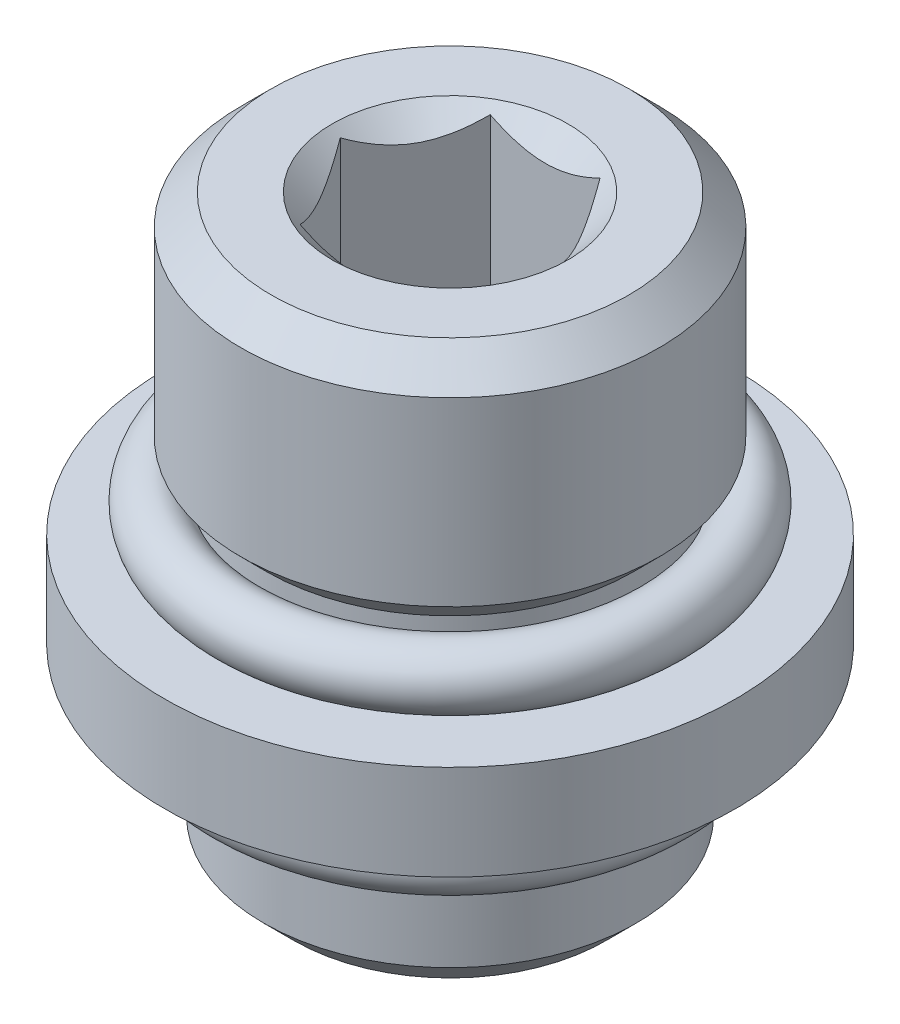
ISO-10303-21;
HEADER;
FILE_DESCRIPTION(('STEP AP214'),'2;1');
FILE_NAME('part.step','',(''),(''),'','','');
FILE_SCHEMA(('AUTOMOTIVE_DESIGN { 1 0 10303 214 1 1 1 1 }'));
ENDSEC;
DATA;
#1=APPLICATION_CONTEXT('core data for automotive mechanical design processes');
#2=APPLICATION_PROTOCOL_DEFINITION('international standard','automotive_design',2000,#1);
#3=PRODUCT_CONTEXT('',#1,'mechanical');
#4=PRODUCT('Part','Part','',(#3));
#5=PRODUCT_RELATED_PRODUCT_CATEGORY('part','',(#4));
#6=PRODUCT_DEFINITION_FORMATION('','',#4);
#7=PRODUCT_DEFINITION_CONTEXT('part definition',#1,'design');
#8=PRODUCT_DEFINITION('design','',#6,#7);
#9=PRODUCT_DEFINITION_SHAPE('','',#8);
#10=(LENGTH_UNIT() NAMED_UNIT(*) SI_UNIT(.MILLI.,.METRE.));
#11=(NAMED_UNIT(*) PLANE_ANGLE_UNIT() SI_UNIT($,.RADIAN.));
#12=(NAMED_UNIT(*) SI_UNIT($,.STERADIAN.) SOLID_ANGLE_UNIT());
#13=UNCERTAINTY_MEASURE_WITH_UNIT(LENGTH_MEASURE(1.E-05),#10,'distance_accuracy_value','');
#14=(GEOMETRIC_REPRESENTATION_CONTEXT(3) GLOBAL_UNCERTAINTY_ASSIGNED_CONTEXT((#13)) GLOBAL_UNIT_ASSIGNED_CONTEXT((#10,
#11,#12)) REPRESENTATION_CONTEXT('',''));
#15=CARTESIAN_POINT('',(0.,0.,0.));
#16=DIRECTION('',(0.,0.,1.));
#17=DIRECTION('',(1.,0.,0.));
#18=AXIS2_PLACEMENT_3D('',#15,#16,#17);
#19=CARTESIAN_POINT('',(0.,-2.87655,0.));
#20=DIRECTION('',(0.,-1.,0.));
#21=DIRECTION('',(0.,0.,-1.));
#22=AXIS2_PLACEMENT_3D('',#19,#20,#21);
#23=CYLINDRICAL_SURFACE('',#22,6.223);
#24=CARTESIAN_POINT('',(0.,-4.36308409543976,0.));
#25=DIRECTION('',(0.,-1.,0.));
#26=DIRECTION('',(-1.,0.,0.));
#27=AXIS2_PLACEMENT_3D('',#24,#25,#26);
#28=CIRCLE('',#27,6.223);
#29=CARTESIAN_POINT('',(-6.223,-4.36308409543976,0.));
#30=VERTEX_POINT('',#29);
#31=EDGE_CURVE('E219',#30,#30,#28,.F.);
#32=ORIENTED_EDGE('',*,*,#31,.F.);
#33=EDGE_LOOP('',(#32));
#34=FACE_BOUND('',#33,.T.);
#35=CARTESIAN_POINT('',(0.,-8.128,0.));
#36=DIRECTION('',(0.,1.,0.));
#37=DIRECTION('',(-1.,0.,0.));
#38=AXIS2_PLACEMENT_3D('',#35,#36,#37);
#39=CIRCLE('',#38,6.223);
#40=CARTESIAN_POINT('',(-6.223,-8.128,0.));
#41=VERTEX_POINT('',#40);
#42=EDGE_CURVE('E94',#41,#41,#39,.F.);
#43=ORIENTED_EDGE('',*,*,#42,.F.);
#44=EDGE_LOOP('',(#43));
#45=FACE_BOUND('',#44,.T.);
#46=ADVANCED_FACE('F15',(#34,#45),#23,.T.);
#47=CARTESIAN_POINT('',(0.,-4.1402,0.));
#48=DIRECTION('',(0.,-1.,0.));
#49=DIRECTION('',(-1.,0.,0.));
#50=AXIS2_PLACEMENT_3D('',#47,#48,#49);
#51=TOROIDAL_SURFACE('',#50,7.1882,0.9906);
#52=ORIENTED_EDGE('',*,*,#31,.T.);
#53=EDGE_LOOP('',(#52));
#54=FACE_BOUND('',#53,.T.);
#55=CARTESIAN_POINT('',(0.,-3.175,0.));
#56=DIRECTION('',(0.,-1.,0.));
#57=DIRECTION('',(1.,0.,0.));
#58=AXIS2_PLACEMENT_3D('',#55,#56,#57);
#59=CIRCLE('',#58,7.41108409543976);
#60=CARTESIAN_POINT('',(7.41108409543976,-3.175,0.));
#61=VERTEX_POINT('',#60);
#62=EDGE_CURVE('E18',#61,#61,#59,.F.);
#63=ORIENTED_EDGE('',*,*,#62,.F.);
#64=EDGE_LOOP('',(#63));
#65=FACE_BOUND('',#64,.T.);
#66=ADVANCED_FACE('F96',(#54,#65),#51,.T.);
#67=CARTESIAN_POINT('',(0.,-8.12800000000001,0.));
#68=DIRECTION('',(0.,1.,0.));
#69=DIRECTION('',(0.,0.,1.));
#70=AXIS2_PLACEMENT_3D('',#67,#68,#69);
#71=CONICAL_SURFACE('',#70,6.223,0.785398163397448);
#72=ORIENTED_EDGE('',*,*,#42,.T.);
#73=EDGE_LOOP('',(#72));
#74=FACE_BOUND('',#73,.T.);
#75=CARTESIAN_POINT('',(0.,-9.144,0.));
#76=DIRECTION('',(0.,1.,0.));
#77=DIRECTION('',(0.,0.,1.));
#78=AXIS2_PLACEMENT_3D('',#75,#76,#77);
#79=CIRCLE('',#78,5.207);
#80=CARTESIAN_POINT('',(0.,-9.144,5.207));
#81=VERTEX_POINT('',#80);
#82=EDGE_CURVE('E212',#81,#81,#79,.F.);
#83=ORIENTED_EDGE('',*,*,#82,.F.);
#84=EDGE_LOOP('',(#83));
#85=FACE_BOUND('',#84,.T.);
#86=ADVANCED_FACE('F99',(#74,#85),#71,.T.);
#87=CARTESIAN_POINT('',(0.,-3.175,0.));
#88=DIRECTION('',(0.,-1.,0.));
#89=DIRECTION('',(0.,0.,-1.));
#90=AXIS2_PLACEMENT_3D('',#87,#88,#89);
#91=PLANE('',#90);
#92=ORIENTED_EDGE('',*,*,#62,.T.);
#93=EDGE_LOOP('',(#92));
#94=FACE_BOUND('',#93,.T.);
#95=CARTESIAN_POINT('',(0.,-3.175,0.));
#96=DIRECTION('',(0.,-1.,0.));
#97=DIRECTION('',(0.,0.,-1.));
#98=AXIS2_PLACEMENT_3D('',#95,#96,#97);
#99=CIRCLE('',#98,9.525);
#100=CARTESIAN_POINT('',(0.,-3.175,-9.525));
#101=VERTEX_POINT('',#100);
#102=EDGE_CURVE('E210',#101,#101,#99,.F.);
#103=ORIENTED_EDGE('',*,*,#102,.F.);
#104=EDGE_LOOP('',(#103));
#105=FACE_BOUND('',#104,.T.);
#106=ADVANCED_FACE('F103',(#94,#105),#91,.T.);
#107=CARTESIAN_POINT('',(0.,-9.144,0.));
#108=DIRECTION('',(0.,-1.,0.));
#109=DIRECTION('',(0.,0.,-1.));
#110=AXIS2_PLACEMENT_3D('',#107,#108,#109);
#111=PLANE('',#110);
#112=DIRECTION('',(-1.,0.,0.));
#113=VECTOR('',#112,1.);
#114=CARTESIAN_POINT('',(1.83308710467706,-9.144,-3.175));
#115=LINE('',#114,#113);
#116=CARTESIAN_POINT('',(1.83308710467706,-9.144,-3.175));
#117=VERTEX_POINT('',#116);
#118=CARTESIAN_POINT('',(-1.83308710467706,-9.144,-3.175));
#119=VERTEX_POINT('',#118);
#120=EDGE_CURVE('E70',#117,#119,#115,.T.);
#121=ORIENTED_EDGE('',*,*,#120,.T.);
#122=DIRECTION('',(-0.5,0.,0.866025403784439));
#123=VECTOR('',#122,1.);
#124=CARTESIAN_POINT('',(-1.83308710467706,-9.144,-3.175));
#125=LINE('',#124,#123);
#126=CARTESIAN_POINT('',(-3.66617420935412,-9.144,0.));
#127=VERTEX_POINT('',#126);
#128=EDGE_CURVE('E75',#119,#127,#125,.T.);
#129=ORIENTED_EDGE('',*,*,#128,.T.);
#130=DIRECTION('',(0.499999999999999,0.,0.866025403784439));
#131=VECTOR('',#130,1.);
#132=CARTESIAN_POINT('',(-3.66617420935412,-9.144,0.));
#133=LINE('',#132,#131);
#134=CARTESIAN_POINT('',(-1.83308710467706,-9.144,3.175));
#135=VERTEX_POINT('',#134);
#136=EDGE_CURVE('E84',#127,#135,#133,.T.);
#137=ORIENTED_EDGE('',*,*,#136,.T.);
#138=DIRECTION('',(1.,0.,0.));
#139=VECTOR('',#138,1.);
#140=CARTESIAN_POINT('',(-1.83308710467706,-9.144,3.175));
#141=LINE('',#140,#139);
#142=CARTESIAN_POINT('',(1.83308710467706,-9.144,3.175));
#143=VERTEX_POINT('',#142);
#144=EDGE_CURVE('E199',#135,#143,#141,.T.);
#145=ORIENTED_EDGE('',*,*,#144,.T.);
#146=DIRECTION('',(0.5,0.,-0.866025403784439));
#147=VECTOR('',#146,1.);
#148=CARTESIAN_POINT('',(1.83308710467706,-9.144,3.175));
#149=LINE('',#148,#147);
#150=CARTESIAN_POINT('',(3.66617420935412,-9.144,0.));
#151=VERTEX_POINT('',#150);
#152=EDGE_CURVE('E57',#143,#151,#149,.T.);
#153=ORIENTED_EDGE('',*,*,#152,.T.);
#154=DIRECTION('',(-0.5,0.,-0.866025403784439));
#155=VECTOR('',#154,1.);
#156=CARTESIAN_POINT('',(3.66617420935412,-9.144,0.));
#157=LINE('',#156,#155);
#158=EDGE_CURVE('E71',#151,#117,#157,.T.);
#159=ORIENTED_EDGE('',*,*,#158,.T.);
#160=EDGE_LOOP('',(#121,#129,#137,#145,#153,#159));
#161=FACE_BOUND('',#160,.T.);
#162=ORIENTED_EDGE('',*,*,#82,.T.);
#163=EDGE_LOOP('',(#162));
#164=FACE_BOUND('',#163,.T.);
#165=ADVANCED_FACE('F73',(#161,#164),#111,.T.);
#166=CARTESIAN_POINT('',(0.,10.56005,0.));
#167=DIRECTION('',(0.,-1.,0.));
#168=DIRECTION('',(0.,0.,-1.));
#169=AXIS2_PLACEMENT_3D('',#166,#167,#168);
#170=CYLINDRICAL_SURFACE('',#169,9.525);
#171=ORIENTED_EDGE('',*,*,#102,.T.);
#172=EDGE_LOOP('',(#171));
#173=FACE_BOUND('',#172,.T.);
#174=CARTESIAN_POINT('',(0.,0.,0.));
#175=DIRECTION('',(0.,-1.,0.));
#176=DIRECTION('',(0.,0.,-1.));
#177=AXIS2_PLACEMENT_3D('',#174,#175,#176);
#178=CIRCLE('',#177,9.525);
#179=CARTESIAN_POINT('',(0.,0.,-9.525));
#180=VERTEX_POINT('',#179);
#181=EDGE_CURVE('E128',#180,#180,#178,.T.);
#182=ORIENTED_EDGE('',*,*,#181,.T.);
#183=EDGE_LOOP('',(#182));
#184=FACE_BOUND('',#183,.T.);
#185=ADVANCED_FACE('F110',(#173,#184),#170,.T.);
#186=CARTESIAN_POINT('',(-1.83308710467706,9.906,-3.175));
#187=DIRECTION('',(-0.866025403784439,0.,-0.5));
#188=DIRECTION('',(-0.5,0.,0.866025403784439));
#189=AXIS2_PLACEMENT_3D('',#186,#187,#188);
#190=PLANE('',#189);
#191=CARTESIAN_POINT('',(-1.83308713979765,9.63517417423354,-3.17499993916936));
#192=CARTESIAN_POINT('',(-1.89609123262347,9.57223054010091,-3.06587364931024));
#193=CARTESIAN_POINT('',(-1.96014876138621,9.51298430612022,-2.95492275488589));
#194=CARTESIAN_POINT('',(-2.09076863609385,9.40450698149839,-2.72868249541396));
#195=CARTESIAN_POINT('',(-2.15734339720593,9.35533622787904,-2.61337162666608));
#196=CARTESIAN_POINT('',(-2.29158812488457,9.27110638833582,-2.38085293767844));
#197=CARTESIAN_POINT('',(-2.35922392199148,9.23583565117596,-2.26370430067884));
#198=CARTESIAN_POINT('',(-2.49598415348421,9.18149439260537,-2.02682863127856));
#199=CARTESIAN_POINT('',(-2.56510441292417,9.16238332261325,-1.90710883009621));
#200=CARTESIAN_POINT('',(-2.68423620941977,9.14513966758307,-1.70076650576886));
#201=CARTESIAN_POINT('',(-2.73409399135498,9.14258777182375,-1.6144102943044));
#202=CARTESIAN_POINT('',(-2.83372839268856,9.14689256654489,-1.44183844901293));
#203=CARTESIAN_POINT('',(-2.88350497751726,9.15375255481848,-1.35562287506235));
#204=CARTESIAN_POINT('',(-2.98258649965805,9.1764894177875,-1.18400864462324));
#205=CARTESIAN_POINT('',(-3.03189084686737,9.19237637380301,-1.09861101022269));
#206=CARTESIAN_POINT('',(-3.12965273361723,9.23230006351596,-0.929282455328126));
#207=CARTESIAN_POINT('',(-3.17811033780147,9.25633617219144,-0.845351422867967));
#208=CARTESIAN_POINT('',(-3.26412520607731,9.30578247625146,-0.696369300807863));
#209=CARTESIAN_POINT('',(-3.30187308284104,9.32989146757205,-0.630988060375239));
#210=CARTESIAN_POINT('',(-3.37669135365627,9.3819939328759,-0.501399013988811));
#211=CARTESIAN_POINT('',(-3.41376172724399,9.40998752397359,-0.437191243479312));
#212=CARTESIAN_POINT('',(-3.48710818282556,9.46923186599025,-0.310151455856949));
#213=CARTESIAN_POINT('',(-3.52338635073298,9.5004723728085,-0.247315825835781));
#214=CARTESIAN_POINT('',(-3.5952710252627,9.56580051754325,-0.12280791726475));
#215=CARTESIAN_POINT('',(-3.63087792734201,9.5998864105674,-0.0611349537632648));
#216=CARTESIAN_POINT('',(-3.66617420935412,9.63517420935413,0.));
#217=B_SPLINE_CURVE_WITH_KNOTS('',3,(#191,#192,#193,#194,#195,#196,#197,#198,#199,#200,#201,
#202,#203,#204,#205,#206,#207,#208,#209,#210,#211,#212,#213,#214,#215,#216),.UNSPECIFIED.,.F.,
.F.,(4,2,2,2,2,2,2,2,2,2,2,2,4),(0.,0.422855838953848,0.848174360902184,1.26674026304907,
1.68425273699741,1.983074335366,2.28200066340576,2.58126149047082,2.88049937008368,
3.11814346304998,3.35579472216068,3.59271772379197,3.82949648833844),.UNSPECIFIED.);
#218=CARTESIAN_POINT('',(-1.83308711154594,9.63517421278857,-3.175));
#219=VERTEX_POINT('',#218);
#220=CARTESIAN_POINT('',(-3.66617420935412,9.63517420935412,0.));
#221=VERTEX_POINT('',#220);
#222=EDGE_CURVE('E121',#219,#221,#217,.T.);
#223=ORIENTED_EDGE('',*,*,#222,.T.);
#224=DIRECTION('',(0.,1.,0.));
#225=VECTOR('',#224,1.);
#226=CARTESIAN_POINT('',(-3.66617420935412,9.906,0.));
#227=LINE('',#226,#225);
#228=EDGE_CURVE('E196',#221,#127,#227,.F.);
#229=ORIENTED_EDGE('',*,*,#228,.T.);
#230=ORIENTED_EDGE('',*,*,#128,.F.);
#231=DIRECTION('',(0.,1.,0.));
#232=VECTOR('',#231,1.);
#233=CARTESIAN_POINT('',(-1.83308710467706,9.906,-3.175));
#234=LINE('',#233,#232);
#235=EDGE_CURVE('E48',#119,#219,#234,.T.);
#236=ORIENTED_EDGE('',*,*,#235,.T.);
#237=EDGE_LOOP('',(#223,#229,#230,#236));
#238=FACE_BOUND('',#237,.T.);
#239=ADVANCED_FACE('F113',(#238),#190,.F.);
#240=CARTESIAN_POINT('',(3.66617420935412,9.906,0.));
#241=DIRECTION('',(0.866025403784439,0.,-0.5));
#242=DIRECTION('',(-0.5,0.,-0.866025403784439));
#243=AXIS2_PLACEMENT_3D('',#240,#241,#242);
#244=PLANE('',#243);
#245=CARTESIAN_POINT('',(3.66617420935412,9.63517420935413,0.));
#246=CARTESIAN_POINT('',(3.60317011447098,9.57223057137181,-0.109126293422495));
#247=CARTESIAN_POINT('',(3.53911258359645,9.5129843335993,-0.220077191504588));
#248=CARTESIAN_POINT('',(3.40849270446008,9.40450700172613,-0.446317458647303));
#249=CARTESIAN_POINT('',(3.34191794102877,9.35533624465642,-0.561628331412195));
#250=CARTESIAN_POINT('',(3.20767320852531,9.27110639893442,-0.794147028756679));
#251=CARTESIAN_POINT('',(3.14003740891493,9.23583565904105,-0.911295670092409));
#252=CARTESIAN_POINT('',(3.00327717225471,9.181494396105,-1.14817134844306));
#253=CARTESIAN_POINT('',(2.93415691015167,9.16238332447344,-1.267891154238));
#254=CARTESIAN_POINT('',(2.81502511083667,9.14513966808837,-1.47423348344868));
#255=CARTESIAN_POINT('',(2.76516732877673,9.14258777193419,-1.5605896951292));
#256=CARTESIAN_POINT('',(2.66553292717444,9.14689256591924,-1.73316154088607));
#257=CARTESIAN_POINT('',(2.61575634220177,9.15375255385183,-1.81937711508601));
#258=CARTESIAN_POINT('',(2.51667481980081,9.17648941620262,-1.99099134597575));
#259=CARTESIAN_POINT('',(2.46737047247486,9.19237637193387,-2.07638898057831));
#260=CARTESIAN_POINT('',(2.36960858548633,9.23230006114457,-2.24571753588626));
#261=CARTESIAN_POINT('',(2.32115098118005,9.25633616960192,-2.32964856855781));
#262=CARTESIAN_POINT('',(2.23513611551726,9.30578247169987,-2.47863068609197));
#263=CARTESIAN_POINT('',(2.1973882414399,9.32989146093453,-2.54401192187166));
#264=CARTESIAN_POINT('',(2.122569975899,9.38199392156499,-2.67360095912269));
#265=CARTESIAN_POINT('',(2.08549960489917,9.40998751007492,-2.73780872514982));
#266=CARTESIAN_POINT('',(2.01215315436107,9.46923184655716,-2.86484850403665));
#267=CARTESIAN_POINT('',(1.97587498891002,9.50047235043249,-2.92768412980325));
#268=CARTESIAN_POINT('',(1.90399031919992,9.56580048899179,-3.05219203002645));
#269=CARTESIAN_POINT('',(1.86838341948404,9.5998863787841,-3.11386498943438));
#270=CARTESIAN_POINT('',(1.83308713979788,9.63517417423331,-3.17499993916896));
#271=B_SPLINE_CURVE_WITH_KNOTS('',3,(#245,#246,#247,#248,#249,#250,#251,#252,#253,#254,#255,
#256,#257,#258,#259,#260,#261,#262,#263,#264,#265,#266,#267,#268,#269,#270),.UNSPECIFIED.,.F.,
.F.,(4,2,2,2,2,2,2,2,2,2,2,2,4),(0.,0.422855855192952,0.84817439375445,1.26674031243719,
1.68425280275631,1.98307440190301,2.28200073072858,2.58126155834513,2.88049943850429,
3.1181435142377,3.3557947560964,3.59271774070924,3.8294964882908),.UNSPECIFIED.);
#272=CARTESIAN_POINT('',(3.66617420935412,9.63517420935413,0.));
#273=VERTEX_POINT('',#272);
#274=CARTESIAN_POINT('',(1.83308712223747,9.63517419179372,-3.17499996958448));
#275=VERTEX_POINT('',#274);
#276=EDGE_CURVE('E81',#273,#275,#271,.T.);
#277=ORIENTED_EDGE('',*,*,#276,.T.);
#278=DIRECTION('',(0.,1.,0.));
#279=VECTOR('',#278,1.);
#280=CARTESIAN_POINT('',(1.83308710467706,9.906,-3.175));
#281=LINE('',#280,#279);
#282=EDGE_CURVE('E78',#275,#117,#281,.F.);
#283=ORIENTED_EDGE('',*,*,#282,.T.);
#284=ORIENTED_EDGE('',*,*,#158,.F.);
#285=DIRECTION('',(0.,1.,0.));
#286=VECTOR('',#285,1.);
#287=CARTESIAN_POINT('',(3.66617420935412,9.906,0.));
#288=LINE('',#287,#286);
#289=EDGE_CURVE('E33',#151,#273,#288,.T.);
#290=ORIENTED_EDGE('',*,*,#289,.T.);
#291=EDGE_LOOP('',(#277,#283,#284,#290));
#292=FACE_BOUND('',#291,.T.);
#293=ADVANCED_FACE('F79',(#292),#244,.F.);
#294=CARTESIAN_POINT('',(1.83308710467706,9.906,-3.175));
#295=DIRECTION('',(0.,0.,-1.));
#296=DIRECTION('',(-1.,0.,0.));
#297=AXIS2_PLACEMENT_3D('',#294,#295,#296);
#298=PLANE('',#297);
#299=CARTESIAN_POINT('',(1.83308711841658,9.63517421622389,-3.175));
#300=CARTESIAN_POINT('',(1.70707892776255,9.57223057744717,-3.175));
#301=CARTESIAN_POINT('',(1.57896386510119,9.51298433889621,-3.175));
#302=CARTESIAN_POINT('',(1.31772410491804,9.40450700554679,-3.175));
#303=CARTESIAN_POINT('',(1.18457457705645,9.3553362477811,-3.175));
#304=CARTESIAN_POINT('',(0.916085110151507,9.27110640088577,-3.175));
#305=CARTESIAN_POINT('',(0.780813510038186,9.23583566049647,-3.175));
#306=CARTESIAN_POINT('',(0.507293034874546,9.18149439676399,-3.175));
#307=CARTESIAN_POINT('',(0.369052509718185,9.16238332483059,-3.175));
#308=CARTESIAN_POINT('',(0.130788910109952,9.14513966818958,-3.175));
#309=CARTESIAN_POINT('',(0.0310733459738741,9.14258777195747,-3.175));
#310=CARTESIAN_POINT('',(-0.168195457270361,9.14689256579097,-3.175));
#311=CARTESIAN_POINT('',(-0.267748627239181,9.15375255364995,-3.175));
#312=CARTESIAN_POINT('',(-0.465911672143355,9.17648941586797,-3.175));
#313=CARTESIAN_POINT('',(-0.564520366873497,9.19237637154456,-3.175));
#314=CARTESIAN_POINT('',(-0.760044141008422,9.23230006066439,-3.175));
#315=CARTESIAN_POINT('',(-0.856959349700574,9.25633616908564,-3.175));
#316=CARTESIAN_POINT('',(-1.02898908881731,9.30578247333306,-3.175));
#317=CARTESIAN_POINT('',(-1.10448484455223,9.32989146519607,-3.175));
#318=CARTESIAN_POINT('',(-1.25412139052253,9.3819939318196,-3.175));
#319=CARTESIAN_POINT('',(-1.32826213983031,9.40998752369468,-3.175));
#320=CARTESIAN_POINT('',(-1.47495505521062,9.46923186746625,-3.175));
#321=CARTESIAN_POINT('',(-1.54751139310987,9.50047237526313,-3.175));
#322=CARTESIAN_POINT('',(-1.69128074625762,9.56580052210323,-3.175));
#323=CARTESIAN_POINT('',(-1.76249455242027,9.59988641625375,-3.175));
#324=CARTESIAN_POINT('',(-1.83308711841481,9.635174216223,-3.175));
#325=B_SPLINE_CURVE_WITH_KNOTS('',3,(#299,#300,#301,#302,#303,#304,#305,#306,#307,#308,#309,
#310,#311,#312,#313,#314,#315,#316,#317,#318,#319,#320,#321,#322,#323,#324),.UNSPECIFIED.,.F.,
.F.,(4,2,2,2,2,2,2,2,2,2,2,2,4),(0.,0.422855858648623,0.848174400738333,1.26674032237553,
1.6842528156194,1.98307441482091,2.28200074370118,2.58126157152126,2.88049945188806,
3.11814355164636,3.35579481755719,3.59271782608776,3.82949659750989),.UNSPECIFIED.);
#326=EDGE_CURVE('E157',#275,#219,#325,.T.);
#327=ORIENTED_EDGE('',*,*,#326,.T.);
#328=ORIENTED_EDGE('',*,*,#235,.F.);
#329=ORIENTED_EDGE('',*,*,#120,.F.);
#330=ORIENTED_EDGE('',*,*,#282,.F.);
#331=EDGE_LOOP('',(#327,#328,#329,#330));
#332=FACE_BOUND('',#331,.T.);
#333=ADVANCED_FACE('F86',(#332),#298,.F.);
#334=CARTESIAN_POINT('',(-3.66617420935412,9.906,0.));
#335=DIRECTION('',(-0.866025403784439,0.,0.499999999999999));
#336=DIRECTION('',(0.499999999999999,0.,0.866025403784439));
#337=AXIS2_PLACEMENT_3D('',#334,#335,#336);
#338=PLANE('',#337);
#339=CARTESIAN_POINT('',(-3.66617420935412,9.63517420935413,0.));
#340=CARTESIAN_POINT('',(-3.60317011447098,9.57223057137181,0.109126293422494));
#341=CARTESIAN_POINT('',(-3.53911258359645,9.5129843335993,0.220077191504588));
#342=CARTESIAN_POINT('',(-3.40849270446007,9.40450700172613,0.446317458647302));
#343=CARTESIAN_POINT('',(-3.34191794102877,9.35533624465642,0.561628331412194));
#344=CARTESIAN_POINT('',(-3.20767320852531,9.27110639893442,0.794147028756677));
#345=CARTESIAN_POINT('',(-3.14003740891493,9.23583565904105,0.911295670092406));
#346=CARTESIAN_POINT('',(-3.00327717225471,9.18149439610499,1.14817134844306));
#347=CARTESIAN_POINT('',(-2.93415691015167,9.16238332447344,1.267891154238));
#348=CARTESIAN_POINT('',(-2.81502511083667,9.14513966808837,1.47423348344868));
#349=CARTESIAN_POINT('',(-2.76516732877673,9.14258777193419,1.56058969512919));
#350=CARTESIAN_POINT('',(-2.66553292717445,9.14689256591924,1.73316154088607));
#351=CARTESIAN_POINT('',(-2.61575634220177,9.15375255385183,1.81937711508601));
#352=CARTESIAN_POINT('',(-2.51667481980081,9.17648941620262,1.99099134597575));
#353=CARTESIAN_POINT('',(-2.46737047247486,9.19237637193387,2.07638898057831));
#354=CARTESIAN_POINT('',(-2.36960858548633,9.23230006114457,2.24571753588625));
#355=CARTESIAN_POINT('',(-2.32115098118005,9.25633616960192,2.3296485685578));
#356=CARTESIAN_POINT('',(-2.23513611551726,9.30578247169987,2.47863068609197));
#357=CARTESIAN_POINT('',(-2.1973882414399,9.32989146093453,2.54401192187166));
#358=CARTESIAN_POINT('',(-2.122569975899,9.38199392156499,2.67360095912269));
#359=CARTESIAN_POINT('',(-2.08549960489917,9.40998751007492,2.73780872514982));
#360=CARTESIAN_POINT('',(-2.01215315436107,9.46923184655716,2.86484850403665));
#361=CARTESIAN_POINT('',(-1.97587498891002,9.50047235043249,2.92768412980325));
#362=CARTESIAN_POINT('',(-1.90399031919992,9.56580048899179,3.05219203002645));
#363=CARTESIAN_POINT('',(-1.86838341948403,9.59988637878411,3.11386498943438));
#364=CARTESIAN_POINT('',(-1.83308713979788,9.63517417423332,3.17499993916897));
#365=B_SPLINE_CURVE_WITH_KNOTS('',3,(#339,#340,#341,#342,#343,#344,#345,#346,#347,#348,#349,
#350,#351,#352,#353,#354,#355,#356,#357,#358,#359,#360,#361,#362,#363,#364),.UNSPECIFIED.,.F.,
.F.,(4,2,2,2,2,2,2,2,2,2,2,2,4),(0.,0.422855855192951,0.848174393754448,1.26674031243719,
1.6842528027563,1.98307440190301,2.28200073072858,2.58126155834512,2.88049943850429,
3.1181435142377,3.35579475609641,3.59271774070925,3.82949648829081),.UNSPECIFIED.);
#366=CARTESIAN_POINT('',(-1.83308712223747,9.63517419179372,3.17499996958448));
#367=VERTEX_POINT('',#366);
#368=EDGE_CURVE('E183',#221,#367,#365,.T.);
#369=ORIENTED_EDGE('',*,*,#368,.T.);
#370=DIRECTION('',(0.,1.,0.));
#371=VECTOR('',#370,1.);
#372=CARTESIAN_POINT('',(-1.83308710467706,9.906,3.175));
#373=LINE('',#372,#371);
#374=EDGE_CURVE('E201',#367,#135,#373,.F.);
#375=ORIENTED_EDGE('',*,*,#374,.T.);
#376=ORIENTED_EDGE('',*,*,#136,.F.);
#377=ORIENTED_EDGE('',*,*,#228,.F.);
#378=EDGE_LOOP('',(#369,#375,#376,#377));
#379=FACE_BOUND('',#378,.T.);
#380=ADVANCED_FACE('F177',(#379),#338,.F.);
#381=CARTESIAN_POINT('',(-1.83308710467706,9.906,3.175));
#382=DIRECTION('',(0.,0.,1.));
#383=DIRECTION('',(1.,0.,0.));
#384=AXIS2_PLACEMENT_3D('',#381,#382,#383);
#385=PLANE('',#384);
#386=CARTESIAN_POINT('',(-1.83308711841659,9.63517421622389,3.175));
#387=CARTESIAN_POINT('',(-1.70707892783386,9.57223057748276,3.175));
#388=CARTESIAN_POINT('',(-1.57896386524659,9.51298433896341,3.175));
#389=CARTESIAN_POINT('',(-1.31772410521638,9.40450700566375,3.175));
#390=CARTESIAN_POINT('',(-1.18457457743365,9.35533624791618,3.175));
#391=CARTESIAN_POINT('',(-0.916085110537739,9.27110640099051,3.175));
#392=CARTESIAN_POINT('',(-0.780813510349744,9.23583566056788,3.175));
#393=CARTESIAN_POINT('',(-0.507293035032677,9.18149439678596,3.175));
#394=CARTESIAN_POINT('',(-0.369052509797589,9.16238332483636,3.175));
#395=CARTESIAN_POINT('',(-0.130788910082071,9.14513966818754,3.175));
#396=CARTESIAN_POINT('',(-0.0310733459179524,9.14258777195603,3.175));
#397=CARTESIAN_POINT('',(0.168195457382573,9.14689256579603,3.175));
#398=CARTESIAN_POINT('',(0.267748627379642,9.15375255366096,3.175));
#399=CARTESIAN_POINT('',(0.465911672283417,9.17648941588916,3.175));
#400=CARTESIAN_POINT('',(0.5645203669855,9.19237637156493,3.175));
#401=CARTESIAN_POINT('',(0.760044141064958,9.23230006067843,3.175));
#402=CARTESIAN_POINT('',(0.856959349729724,9.25633616909403,3.175));
#403=CARTESIAN_POINT('',(1.02898908126639,9.3057824711627,3.175));
#404=CARTESIAN_POINT('',(1.104484829578,9.32989146041423,3.175));
#405=CARTESIAN_POINT('',(1.25412136096867,9.38199392109715,3.175));
#406=CARTESIAN_POINT('',(1.32826210312027,9.40998750964265,3.175));
#407=CARTESIAN_POINT('',(1.47495500450123,9.46923184621388,3.175));
#408=CARTESIAN_POINT('',(1.54751133555601,9.50047235014289,3.175));
#409=CARTESIAN_POINT('',(1.69128067527559,9.56580048882209,3.175));
#410=CARTESIAN_POINT('',(1.76249447485408,9.59988637868058,3.175));
#411=CARTESIAN_POINT('',(1.83308703437049,9.63517417420084,3.175));
#412=B_SPLINE_CURVE_WITH_KNOTS('',3,(#386,#387,#388,#389,#390,#391,#392,#393,#394,#395,#396,
#397,#398,#399,#400,#401,#402,#403,#404,#405,#406,#407,#408,#409,#410,#411),.UNSPECIFIED.,.F.,
.F.,(4,2,2,2,2,2,2,2,2,2,2,2,4),(0.,0.422855858408477,0.848174400258579,1.26674032213663,
1.68425281561912,1.9830744149044,2.28200074386982,2.58126157160763,2.88049945188776,
3.11814352808406,3.35579477040624,3.59271775550305,3.82949650356678),.UNSPECIFIED.);
#413=CARTESIAN_POINT('',(1.83308706952378,9.63517419177749,3.175));
#414=VERTEX_POINT('',#413);
#415=EDGE_CURVE('E148',#367,#414,#412,.T.);
#416=ORIENTED_EDGE('',*,*,#415,.T.);
#417=DIRECTION('',(0.,1.,0.));
#418=VECTOR('',#417,1.);
#419=CARTESIAN_POINT('',(1.83308710467706,9.906,3.175));
#420=LINE('',#419,#418);
#421=EDGE_CURVE('E206',#414,#143,#420,.F.);
#422=ORIENTED_EDGE('',*,*,#421,.T.);
#423=ORIENTED_EDGE('',*,*,#144,.F.);
#424=ORIENTED_EDGE('',*,*,#374,.F.);
#425=EDGE_LOOP('',(#416,#422,#423,#424));
#426=FACE_BOUND('',#425,.T.);
#427=ADVANCED_FACE('F172',(#426),#385,.F.);
#428=CARTESIAN_POINT('',(1.83308710467706,9.906,3.175));
#429=DIRECTION('',(0.866025403784439,0.,0.5));
#430=DIRECTION('',(0.5,0.,-0.866025403784439));
#431=AXIS2_PLACEMENT_3D('',#428,#429,#430);
#432=PLANE('',#431);
#433=CARTESIAN_POINT('',(1.83308709784089,9.63517421619031,3.1750000118406));
#434=CARTESIAN_POINT('',(1.89609119316008,9.57223057742311,3.06587371766284));
#435=CARTESIAN_POINT('',(1.96014872448266,9.51298433888097,2.95492281880471));
#436=CARTESIAN_POINT('',(2.09076860455743,9.40450700554666,2.72868255003664));
#437=CARTESIAN_POINT('',(2.15734336847954,9.35533624778724,2.61337167642166));
#438=CARTESIAN_POINT('',(2.29158810192665,9.27110640089284,2.38085297744271));
#439=CARTESIAN_POINT('',(2.35922390198705,9.23583566050068,2.26370433532753));
#440=CARTESIAN_POINT('',(2.49598413957653,9.18149439676426,2.02682865536736));
#441=CARTESIAN_POINT('',(2.56510440215863,9.16238332482976,1.90710884874267));
#442=CARTESIAN_POINT('',(2.68423620196886,9.14513966818877,1.70076651867422));
#443=CARTESIAN_POINT('',(2.73409398403908,9.14258777195713,1.6144103069759));
#444=CARTESIAN_POINT('',(2.83372838566557,9.1468925657924,1.44183846117711));
#445=CARTESIAN_POINT('',(2.88350497065216,9.15375255365269,1.35562288695306));
#446=CARTESIAN_POINT('',(2.98258649310396,9.17648941587296,1.18400865597525));
#447=CARTESIAN_POINT('',(3.03189084046662,9.19237637154969,1.09861102130911));
#448=CARTESIAN_POINT('',(3.1296527275293,9.23230006066896,0.929282465872741));
#449=CARTESIAN_POINT('',(3.17811033187301,9.25633616908949,0.845351433136365));
#450=CARTESIAN_POINT('',(3.26412520081133,9.30578247298092,0.696369309928808));
#451=CARTESIAN_POINT('',(3.3018730780717,9.32989146441697,0.630988068635987));
#452=CARTESIAN_POINT('',(3.37669134986448,9.38199393006917,0.501399020556385));
#453=CARTESIAN_POINT('',(3.41376172393312,9.40998752139982,0.437191249213926));
#454=CARTESIAN_POINT('',(3.48710818047834,9.46923186399397,0.310151459922449));
#455=CARTESIAN_POINT('',(3.52338634886819,9.50047237115834,0.247315829065695));
#456=CARTESIAN_POINT('',(3.59527102434383,9.56580051666385,0.122807918856283));
#457=CARTESIAN_POINT('',(3.63087792688667,9.59988641011246,0.0611349545519394));
#458=CARTESIAN_POINT('',(3.66617420935412,9.63517420935413,0.));
#459=B_SPLINE_CURVE_WITH_KNOTS('',3,(#433,#434,#435,#436,#437,#438,#439,#440,#441,#442,#443,
#444,#445,#446,#447,#448,#449,#450,#451,#452,#453,#454,#455,#456,#457,#458),.UNSPECIFIED.,.F.,
.F.,(4,2,2,2,2,2,2,2,2,2,2,2,4),(0.,0.422855858593648,0.848174400628113,1.26674032228906,
1.68425281555647,1.983074414771,2.2820007436645,2.58126157147053,2.88049945182258,
3.11814354772712,3.35579480977983,3.5927178144775,3.82949658207905),.UNSPECIFIED.);
#460=EDGE_CURVE('E162',#414,#273,#459,.T.);
#461=ORIENTED_EDGE('',*,*,#460,.T.);
#462=ORIENTED_EDGE('',*,*,#289,.F.);
#463=ORIENTED_EDGE('',*,*,#152,.F.);
#464=ORIENTED_EDGE('',*,*,#421,.F.);
#465=EDGE_LOOP('',(#461,#462,#463,#464));
#466=FACE_BOUND('',#465,.T.);
#467=ADVANCED_FACE('F169',(#466),#432,.F.);
#468=CARTESIAN_POINT('',(0.,0.,0.));
#469=DIRECTION('',(0.,-1.,0.));
#470=DIRECTION('',(0.,0.,-1.));
#471=AXIS2_PLACEMENT_3D('',#468,#469,#470);
#472=PLANE('',#471);
#473=CARTESIAN_POINT('',(0.,0.,0.));
#474=DIRECTION('',(0.,-1.,0.));
#475=DIRECTION('',(1.,0.,0.));
#476=AXIS2_PLACEMENT_3D('',#473,#474,#475);
#477=CIRCLE('',#476,7.28408409543975);
#478=CARTESIAN_POINT('',(7.28408409543975,0.,0.));
#479=VERTEX_POINT('',#478);
#480=EDGE_CURVE('E167',#479,#479,#477,.F.);
#481=ORIENTED_EDGE('',*,*,#480,.F.);
#482=EDGE_LOOP('',(#481));
#483=FACE_BOUND('',#482,.T.);
#484=ORIENTED_EDGE('',*,*,#181,.F.);
#485=EDGE_LOOP('',(#484));
#486=FACE_BOUND('',#485,.T.);
#487=ADVANCED_FACE('F140',(#483,#486),#472,.F.);
#488=CARTESIAN_POINT('',(0.,9.906,0.));
#489=DIRECTION('',(0.,1.,0.));
#490=DIRECTION('',(0.,0.,1.));
#491=AXIS2_PLACEMENT_3D('',#488,#489,#490);
#492=CONICAL_SURFACE('',#491,3.93699999999999,0.785398163397448);
#493=CARTESIAN_POINT('',(0.,9.906,0.));
#494=DIRECTION('',(0.,1.,0.));
#495=DIRECTION('',(0.,0.,1.));
#496=AXIS2_PLACEMENT_3D('',#493,#494,#495);
#497=CIRCLE('',#496,3.937);
#498=CARTESIAN_POINT('',(0.,9.906,3.937));
#499=VERTEX_POINT('',#498);
#500=EDGE_CURVE('E228',#499,#499,#497,.T.);
#501=ORIENTED_EDGE('',*,*,#500,.T.);
#502=EDGE_LOOP('',(#501));
#503=FACE_BOUND('',#502,.T.);
#504=ORIENTED_EDGE('',*,*,#276,.F.);
#505=ORIENTED_EDGE('',*,*,#460,.F.);
#506=ORIENTED_EDGE('',*,*,#415,.F.);
#507=ORIENTED_EDGE('',*,*,#368,.F.);
#508=ORIENTED_EDGE('',*,*,#222,.F.);
#509=ORIENTED_EDGE('',*,*,#326,.F.);
#510=EDGE_LOOP('',(#504,#505,#506,#507,#508,#509));
#511=FACE_BOUND('',#510,.T.);
#512=ADVANCED_FACE('F134',(#503,#511),#492,.F.);
#513=CARTESIAN_POINT('',(0.,0.9652,0.));
#514=DIRECTION('',(0.,-1.,0.));
#515=DIRECTION('',(-1.,0.,0.));
#516=AXIS2_PLACEMENT_3D('',#513,#514,#515);
#517=TOROIDAL_SURFACE('',#516,7.0612,0.9906);
#518=ORIENTED_EDGE('',*,*,#480,.T.);
#519=EDGE_LOOP('',(#518));
#520=FACE_BOUND('',#519,.T.);
#521=CARTESIAN_POINT('',(0.,1.18808409543976,0.));
#522=DIRECTION('',(0.,-1.,0.));
#523=DIRECTION('',(0.,0.,-1.));
#524=AXIS2_PLACEMENT_3D('',#521,#522,#523);
#525=CIRCLE('',#524,6.096);
#526=CARTESIAN_POINT('',(0.,1.18808409543976,-6.096));
#527=VERTEX_POINT('',#526);
#528=EDGE_CURVE('E227',#527,#527,#525,.F.);
#529=ORIENTED_EDGE('',*,*,#528,.F.);
#530=EDGE_LOOP('',(#529));
#531=FACE_BOUND('',#530,.T.);
#532=ADVANCED_FACE('F139',(#520,#531),#517,.T.);
#533=CARTESIAN_POINT('',(0.,9.906,0.));
#534=DIRECTION('',(0.,-1.,0.));
#535=DIRECTION('',(0.,0.,-1.));
#536=AXIS2_PLACEMENT_3D('',#533,#534,#535);
#537=PLANE('',#536);
#538=ORIENTED_EDGE('',*,*,#500,.F.);
#539=EDGE_LOOP('',(#538));
#540=FACE_BOUND('',#539,.T.);
#541=CARTESIAN_POINT('',(0.,9.906,0.));
#542=DIRECTION('',(0.,-1.,0.));
#543=DIRECTION('',(0.,0.,-1.));
#544=AXIS2_PLACEMENT_3D('',#541,#542,#543);
#545=CIRCLE('',#544,5.969);
#546=CARTESIAN_POINT('',(0.,9.906,-5.969));
#547=VERTEX_POINT('',#546);
#548=EDGE_CURVE('E224',#547,#547,#545,.T.);
#549=ORIENTED_EDGE('',*,*,#548,.F.);
#550=EDGE_LOOP('',(#549));
#551=FACE_BOUND('',#550,.T.);
#552=ADVANCED_FACE('F261',(#540,#551),#537,.F.);
#553=CARTESIAN_POINT('',(0.,10.56005,0.));
#554=DIRECTION('',(0.,-1.,0.));
#555=DIRECTION('',(0.,0.,-1.));
#556=AXIS2_PLACEMENT_3D('',#553,#554,#555);
#557=CYLINDRICAL_SURFACE('',#556,6.096);
#558=ORIENTED_EDGE('',*,*,#528,.T.);
#559=EDGE_LOOP('',(#558));
#560=FACE_BOUND('',#559,.T.);
#561=CARTESIAN_POINT('',(0.,1.9558,0.));
#562=DIRECTION('',(0.,1.,0.));
#563=DIRECTION('',(-1.,0.,0.));
#564=AXIS2_PLACEMENT_3D('',#561,#562,#563);
#565=CIRCLE('',#564,6.096);
#566=CARTESIAN_POINT('',(-6.096,1.9558,0.));
#567=VERTEX_POINT('',#566);
#568=EDGE_CURVE('E226',#567,#567,#565,.T.);
#569=ORIENTED_EDGE('',*,*,#568,.F.);
#570=EDGE_LOOP('',(#569));
#571=FACE_BOUND('',#570,.T.);
#572=ADVANCED_FACE('F257',(#560,#571),#557,.T.);
#573=CARTESIAN_POINT('',(0.,8.89,0.));
#574=DIRECTION('',(0.,-1.,0.));
#575=DIRECTION('',(0.,0.,-1.));
#576=AXIS2_PLACEMENT_3D('',#573,#574,#575);
#577=CONICAL_SURFACE('',#576,6.98499999999999,0.785398163397448);
#578=CARTESIAN_POINT('',(0.,8.89,0.));
#579=DIRECTION('',(0.,-1.,0.));
#580=DIRECTION('',(0.,0.,-1.));
#581=AXIS2_PLACEMENT_3D('',#578,#579,#580);
#582=CIRCLE('',#581,6.985);
#583=CARTESIAN_POINT('',(0.,8.89,-6.985));
#584=VERTEX_POINT('',#583);
#585=EDGE_CURVE('E24',#584,#584,#582,.T.);
#586=ORIENTED_EDGE('',*,*,#585,.F.);
#587=EDGE_LOOP('',(#586));
#588=FACE_BOUND('',#587,.T.);
#589=ORIENTED_EDGE('',*,*,#548,.T.);
#590=EDGE_LOOP('',(#589));
#591=FACE_BOUND('',#590,.T.);
#592=ADVANCED_FACE('F253',(#588,#591),#577,.T.);
#593=CARTESIAN_POINT('',(0.,2.8448,0.));
#594=DIRECTION('',(0.,1.,0.));
#595=DIRECTION('',(0.,0.,1.));
#596=AXIS2_PLACEMENT_3D('',#593,#594,#595);
#597=CONICAL_SURFACE('',#596,6.98499999999999,0.785398163397448);
#598=ORIENTED_EDGE('',*,*,#568,.T.);
#599=EDGE_LOOP('',(#598));
#600=FACE_BOUND('',#599,.T.);
#601=CARTESIAN_POINT('',(0.,2.8448,0.));
#602=DIRECTION('',(0.,-1.,0.));
#603=DIRECTION('',(0.,0.,-1.));
#604=AXIS2_PLACEMENT_3D('',#601,#602,#603);
#605=CIRCLE('',#604,6.985);
#606=CARTESIAN_POINT('',(0.,2.8448,-6.985));
#607=VERTEX_POINT('',#606);
#608=EDGE_CURVE('E9',#607,#607,#605,.F.);
#609=ORIENTED_EDGE('',*,*,#608,.F.);
#610=EDGE_LOOP('',(#609));
#611=FACE_BOUND('',#610,.T.);
#612=ADVANCED_FACE('F256',(#600,#611),#597,.T.);
#613=CARTESIAN_POINT('',(0.,10.56005,0.));
#614=DIRECTION('',(0.,-1.,0.));
#615=DIRECTION('',(0.,0.,-1.));
#616=AXIS2_PLACEMENT_3D('',#613,#614,#615);
#617=CYLINDRICAL_SURFACE('',#616,6.985);
#618=ORIENTED_EDGE('',*,*,#608,.T.);
#619=EDGE_LOOP('',(#618));
#620=FACE_BOUND('',#619,.T.);
#621=ORIENTED_EDGE('',*,*,#585,.T.);
#622=EDGE_LOOP('',(#621));
#623=FACE_BOUND('',#622,.T.);
#624=ADVANCED_FACE('F251',(#620,#623),#617,.T.);
#625=CLOSED_SHELL('',(#46,#66,#86,#106,#165,#185,#239,#293,#333,#380,#427,#467,#487,#512,#532,
#552,#572,#592,#612,#624));
#626=MANIFOLD_SOLID_BREP('B1',#625);
#627=ADVANCED_BREP_SHAPE_REPRESENTATION('',(#18,#626),#14);
#628=SHAPE_DEFINITION_REPRESENTATION(#9,#627);
ENDSEC;
END-ISO-10303-21;
